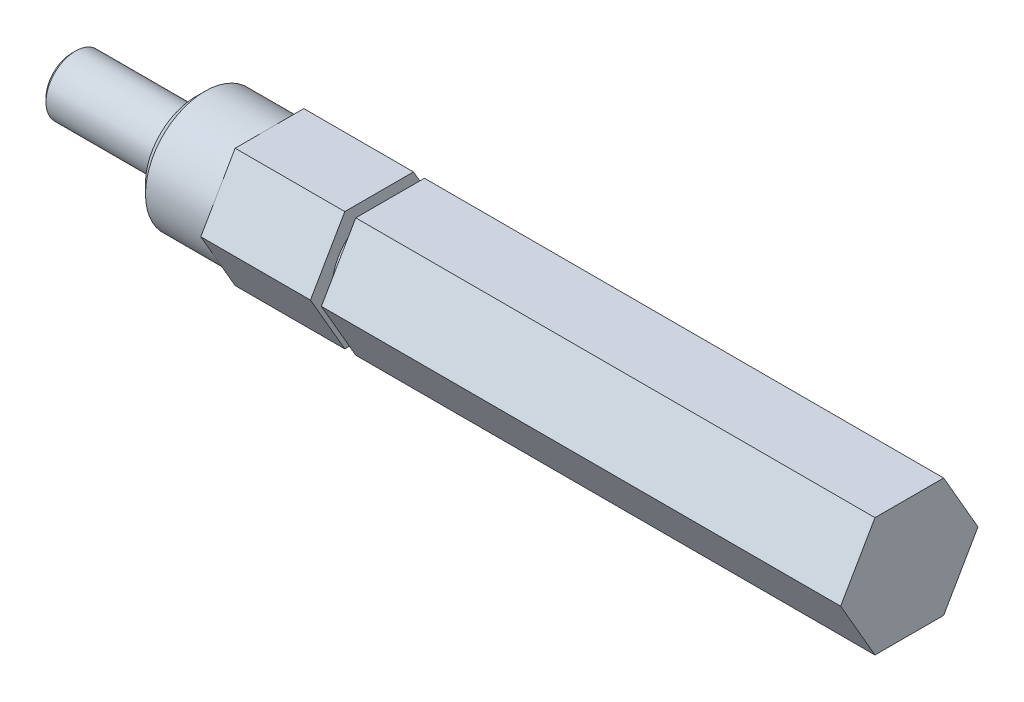
ISO-10303-21;
HEADER;
FILE_DESCRIPTION(('STEP AP214'),'2;1');
FILE_NAME('part.step','',(''),(''),'','','');
FILE_SCHEMA(('AUTOMOTIVE_DESIGN { 1 0 10303 214 1 1 1 1 }'));
ENDSEC;
DATA;
#1=APPLICATION_CONTEXT('core data for automotive mechanical design processes');
#2=APPLICATION_PROTOCOL_DEFINITION('international standard','automotive_design',2000,#1);
#3=PRODUCT_CONTEXT('',#1,'mechanical');
#4=PRODUCT('Part','Part','',(#3));
#5=PRODUCT_RELATED_PRODUCT_CATEGORY('part','',(#4));
#6=PRODUCT_DEFINITION_FORMATION('','',#4);
#7=PRODUCT_DEFINITION_CONTEXT('part definition',#1,'design');
#8=PRODUCT_DEFINITION('design','',#6,#7);
#9=PRODUCT_DEFINITION_SHAPE('','',#8);
#10=(LENGTH_UNIT() NAMED_UNIT(*) SI_UNIT(.MILLI.,.METRE.));
#11=(NAMED_UNIT(*) PLANE_ANGLE_UNIT() SI_UNIT($,.RADIAN.));
#12=(NAMED_UNIT(*) SI_UNIT($,.STERADIAN.) SOLID_ANGLE_UNIT());
#13=UNCERTAINTY_MEASURE_WITH_UNIT(LENGTH_MEASURE(1.E-05),#10,'distance_accuracy_value','');
#14=(GEOMETRIC_REPRESENTATION_CONTEXT(3) GLOBAL_UNCERTAINTY_ASSIGNED_CONTEXT((#13)) GLOBAL_UNIT_ASSIGNED_CONTEXT((#10,
#11,#12)) REPRESENTATION_CONTEXT('',''));
#15=CARTESIAN_POINT('',(0.,0.,0.));
#16=DIRECTION('',(0.,0.,1.));
#17=DIRECTION('',(1.,0.,0.));
#18=AXIS2_PLACEMENT_3D('',#15,#16,#17);
#19=CARTESIAN_POINT('',(63.5,-6.35000000000002,-3.66617420935411));
#20=DIRECTION('',(0.,0.499999999999998,0.86602540378444));
#21=DIRECTION('',(0.,-0.86602540378444,0.499999999999998));
#22=AXIS2_PLACEMENT_3D('',#19,#20,#21);
#23=PLANE('',#22);
#24=DIRECTION('',(0.,0.86602540378444,-0.499999999999998));
#25=VECTOR('',#24,1.);
#26=CARTESIAN_POINT('',(12.7,-6.35000000000002,-3.66617420935411));
#27=LINE('',#26,#25);
#28=CARTESIAN_POINT('',(12.7,-6.35000000000002,-3.66617420935411));
#29=VERTEX_POINT('',#28);
#30=CARTESIAN_POINT('',(12.7,0.,-7.33234841870824));
#31=VERTEX_POINT('',#30);
#32=EDGE_CURVE('E142',#29,#31,#27,.T.);
#33=ORIENTED_EDGE('',*,*,#32,.F.);
#34=DIRECTION('',(1.,0.,0.));
#35=VECTOR('',#34,1.);
#36=CARTESIAN_POINT('',(63.5,-6.35000000000002,-3.66617420935411));
#37=LINE('',#36,#35);
#38=CARTESIAN_POINT('',(-42.7355,-6.35000000000002,-3.66617420935411));
#39=VERTEX_POINT('',#38);
#40=EDGE_CURVE('E40',#29,#39,#37,.F.);
#41=ORIENTED_EDGE('',*,*,#40,.T.);
#42=DIRECTION('',(0.,-0.86602540378444,0.499999999999999));
#43=VECTOR('',#42,1.);
#44=CARTESIAN_POINT('',(-42.7355,0.,-7.33234841870824));
#45=LINE('',#44,#43);
#46=CARTESIAN_POINT('',(-42.7355,0.,-7.33234841870824));
#47=VERTEX_POINT('',#46);
#48=EDGE_CURVE('E207',#47,#39,#45,.T.);
#49=ORIENTED_EDGE('',*,*,#48,.F.);
#50=DIRECTION('',(1.,0.,0.));
#51=VECTOR('',#50,1.);
#52=CARTESIAN_POINT('',(63.5,0.,-7.33234841870824));
#53=LINE('',#52,#51);
#54=EDGE_CURVE('E210',#47,#31,#53,.T.);
#55=ORIENTED_EDGE('',*,*,#54,.T.);
#56=EDGE_LOOP('',(#33,#41,#49,#55));
#57=FACE_BOUND('',#56,.T.);
#58=ADVANCED_FACE('F36',(#57),#23,.F.);
#59=CARTESIAN_POINT('',(63.5,0.,-7.33234841870824));
#60=DIRECTION('',(0.,-0.5,0.866025403784439));
#61=DIRECTION('',(0.,-0.866025403784439,-0.5));
#62=AXIS2_PLACEMENT_3D('',#59,#60,#61);
#63=PLANE('',#62);
#64=DIRECTION('',(0.,0.866025403784439,0.5));
#65=VECTOR('',#64,1.);
#66=CARTESIAN_POINT('',(12.7,0.,-7.33234841870824));
#67=LINE('',#66,#65);
#68=CARTESIAN_POINT('',(12.7,6.35,-3.66617420935412));
#69=VERTEX_POINT('',#68);
#70=EDGE_CURVE('E658',#31,#69,#67,.T.);
#71=ORIENTED_EDGE('',*,*,#70,.F.);
#72=ORIENTED_EDGE('',*,*,#54,.F.);
#73=DIRECTION('',(0.,-0.866025403784439,-0.499999999999999));
#74=VECTOR('',#73,1.);
#75=CARTESIAN_POINT('',(-42.7355,6.35,-3.66617420935412));
#76=LINE('',#75,#74);
#77=CARTESIAN_POINT('',(-42.7355,6.35,-3.66617420935412));
#78=VERTEX_POINT('',#77);
#79=EDGE_CURVE('E195',#78,#47,#76,.T.);
#80=ORIENTED_EDGE('',*,*,#79,.F.);
#81=DIRECTION('',(1.,0.,0.));
#82=VECTOR('',#81,1.);
#83=CARTESIAN_POINT('',(63.5,6.35,-3.66617420935412));
#84=LINE('',#83,#82);
#85=EDGE_CURVE('E190',#78,#69,#84,.T.);
#86=ORIENTED_EDGE('',*,*,#85,.T.);
#87=EDGE_LOOP('',(#71,#72,#80,#86));
#88=FACE_BOUND('',#87,.T.);
#89=ADVANCED_FACE('F384',(#88),#63,.F.);
#90=CARTESIAN_POINT('',(63.5,-6.35000000000002,3.66617420935409));
#91=DIRECTION('',(0.,1.,0.));
#92=DIRECTION('',(0.,0.,1.));
#93=AXIS2_PLACEMENT_3D('',#90,#91,#92);
#94=PLANE('',#93);
#95=DIRECTION('',(0.,0.,-1.));
#96=VECTOR('',#95,1.);
#97=CARTESIAN_POINT('',(12.7,-6.35000000000002,3.66617420935409));
#98=LINE('',#97,#96);
#99=CARTESIAN_POINT('',(12.7,-6.34999999999997,3.66617420935412));
#100=VERTEX_POINT('',#99);
#101=EDGE_CURVE('E659',#100,#29,#98,.T.);
#102=ORIENTED_EDGE('',*,*,#101,.F.);
#103=DIRECTION('',(1.,0.,0.));
#104=VECTOR('',#103,1.);
#105=CARTESIAN_POINT('',(63.5,-6.34999999999997,3.66617420935412));
#106=LINE('',#105,#104);
#107=CARTESIAN_POINT('',(-42.7355000000001,-6.34999999999999,3.66617420935411));
#108=VERTEX_POINT('',#107);
#109=EDGE_CURVE('E163',#100,#108,#106,.F.);
#110=ORIENTED_EDGE('',*,*,#109,.T.);
#111=DIRECTION('',(0.,0.,1.));
#112=VECTOR('',#111,1.);
#113=CARTESIAN_POINT('',(-42.7355,-6.35000000000002,0.));
#114=LINE('',#113,#112);
#115=EDGE_CURVE('E205',#39,#108,#114,.T.);
#116=ORIENTED_EDGE('',*,*,#115,.F.);
#117=ORIENTED_EDGE('',*,*,#40,.F.);
#118=EDGE_LOOP('',(#102,#110,#116,#117));
#119=FACE_BOUND('',#118,.T.);
#120=ADVANCED_FACE('F390',(#119),#94,.F.);
#121=CARTESIAN_POINT('',(63.5,6.35,-3.66617420935412));
#122=DIRECTION('',(0.,-1.,0.));
#123=DIRECTION('',(0.,0.,-1.));
#124=AXIS2_PLACEMENT_3D('',#121,#122,#123);
#125=PLANE('',#124);
#126=DIRECTION('',(0.,0.,1.));
#127=VECTOR('',#126,1.);
#128=CARTESIAN_POINT('',(12.7,6.35,-3.66617420935412));
#129=LINE('',#128,#127);
#130=CARTESIAN_POINT('',(12.7,6.35,3.6661742093541));
#131=VERTEX_POINT('',#130);
#132=EDGE_CURVE('E53',#69,#131,#129,.T.);
#133=ORIENTED_EDGE('',*,*,#132,.F.);
#134=ORIENTED_EDGE('',*,*,#85,.F.);
#135=DIRECTION('',(0.,0.,-1.));
#136=VECTOR('',#135,1.);
#137=CARTESIAN_POINT('',(-42.7355,6.35,-3.66617420935412));
#138=LINE('',#137,#136);
#139=CARTESIAN_POINT('',(-42.7355,6.35,3.6661742093541));
#140=VERTEX_POINT('',#139);
#141=EDGE_CURVE('E62',#140,#78,#138,.T.);
#142=ORIENTED_EDGE('',*,*,#141,.F.);
#143=DIRECTION('',(1.,0.,0.));
#144=VECTOR('',#143,1.);
#145=CARTESIAN_POINT('',(63.5,6.35,3.6661742093541));
#146=LINE('',#145,#144);
#147=EDGE_CURVE('E169',#140,#131,#146,.T.);
#148=ORIENTED_EDGE('',*,*,#147,.T.);
#149=EDGE_LOOP('',(#133,#134,#142,#148));
#150=FACE_BOUND('',#149,.T.);
#151=ADVANCED_FACE('F566',(#150),#125,.F.);
#152=CARTESIAN_POINT('',(63.5,0.,7.33234841870822));
#153=DIRECTION('',(0.,0.5,-0.866025403784439));
#154=DIRECTION('',(0.,0.866025403784439,0.5));
#155=AXIS2_PLACEMENT_3D('',#152,#153,#154);
#156=PLANE('',#155);
#157=DIRECTION('',(0.,-0.866025403784439,-0.5));
#158=VECTOR('',#157,1.);
#159=CARTESIAN_POINT('',(12.7,0.,7.33234841870822));
#160=LINE('',#159,#158);
#161=CARTESIAN_POINT('',(12.7,0.,7.33234841870822));
#162=VERTEX_POINT('',#161);
#163=EDGE_CURVE('E154',#162,#100,#160,.T.);
#164=ORIENTED_EDGE('',*,*,#163,.F.);
#165=DIRECTION('',(1.,0.,0.));
#166=VECTOR('',#165,1.);
#167=CARTESIAN_POINT('',(63.5,0.,7.33234841870822));
#168=LINE('',#167,#166);
#169=CARTESIAN_POINT('',(-42.7355,0.,7.33234841870822));
#170=VERTEX_POINT('',#169);
#171=EDGE_CURVE('E46',#162,#170,#168,.F.);
#172=ORIENTED_EDGE('',*,*,#171,.T.);
#173=DIRECTION('',(0.,0.866025403784439,0.5));
#174=VECTOR('',#173,1.);
#175=CARTESIAN_POINT('',(-42.7355000000001,0.,7.33234841870822));
#176=LINE('',#175,#174);
#177=EDGE_CURVE('E184',#108,#170,#176,.T.);
#178=ORIENTED_EDGE('',*,*,#177,.F.);
#179=ORIENTED_EDGE('',*,*,#109,.F.);
#180=EDGE_LOOP('',(#164,#172,#178,#179));
#181=FACE_BOUND('',#180,.T.);
#182=ADVANCED_FACE('F160',(#181),#156,.F.);
#183=CARTESIAN_POINT('',(63.5,6.35,3.6661742093541));
#184=DIRECTION('',(0.,-0.499999999999999,-0.866025403784439));
#185=DIRECTION('',(0.,0.866025403784439,-0.499999999999999));
#186=AXIS2_PLACEMENT_3D('',#183,#184,#185);
#187=PLANE('',#186);
#188=DIRECTION('',(0.,-0.866025403784439,0.499999999999999));
#189=VECTOR('',#188,1.);
#190=CARTESIAN_POINT('',(12.7,6.35,3.6661742093541));
#191=LINE('',#190,#189);
#192=EDGE_CURVE('E11',#131,#162,#191,.T.);
#193=ORIENTED_EDGE('',*,*,#192,.F.);
#194=ORIENTED_EDGE('',*,*,#147,.F.);
#195=DIRECTION('',(0.,0.866025403784439,-0.499999999999999));
#196=VECTOR('',#195,1.);
#197=CARTESIAN_POINT('',(-42.7355,6.35,3.6661742093541));
#198=LINE('',#197,#196);
#199=EDGE_CURVE('E167',#170,#140,#198,.T.);
#200=ORIENTED_EDGE('',*,*,#199,.F.);
#201=ORIENTED_EDGE('',*,*,#171,.F.);
#202=EDGE_LOOP('',(#193,#194,#200,#201));
#203=FACE_BOUND('',#202,.T.);
#204=ADVANCED_FACE('F165',(#203),#187,.F.);
#205=CARTESIAN_POINT('',(-76.708,0.,0.));
#206=DIRECTION('',(-1.,0.,0.));
#207=DIRECTION('',(0.,0.,1.));
#208=AXIS2_PLACEMENT_3D('',#205,#206,#207);
#209=PLANE('',#208);
#210=CARTESIAN_POINT('',(-76.7079999999964,0.,0.));
#211=DIRECTION('',(1.,0.,0.));
#212=DIRECTION('',(0.,0.,-1.));
#213=AXIS2_PLACEMENT_3D('',#210,#211,#212);
#214=CIRCLE('',#213,2.76860000002443);
#215=CARTESIAN_POINT('',(-76.7079999999964,0.,-2.76860000002443));
#216=VERTEX_POINT('',#215);
#217=EDGE_CURVE('E174',#216,#216,#214,.T.);
#218=ORIENTED_EDGE('',*,*,#217,.F.);
#219=EDGE_LOOP('',(#218));
#220=FACE_BOUND('',#219,.T.);
#221=ADVANCED_FACE('F38',(#220),#209,.T.);
#222=CARTESIAN_POINT('',(-76.326999999992,0.,0.));
#223=DIRECTION('',(1.,0.,0.));
#224=DIRECTION('',(0.,0.,-1.));
#225=AXIS2_PLACEMENT_3D('',#222,#223,#224);
#226=CONICAL_SURFACE('',#225,3.149599999972,0.785398163322851);
#227=ORIENTED_EDGE('',*,*,#217,.T.);
#228=EDGE_LOOP('',(#227));
#229=FACE_BOUND('',#228,.T.);
#230=CARTESIAN_POINT('',(-76.327,0.,0.));
#231=DIRECTION('',(1.,0.,0.));
#232=DIRECTION('',(0.,0.,-1.));
#233=AXIS2_PLACEMENT_3D('',#230,#231,#232);
#234=CIRCLE('',#233,3.1496);
#235=CARTESIAN_POINT('',(-76.327,0.,-3.1496));
#236=VERTEX_POINT('',#235);
#237=EDGE_CURVE('E336',#236,#236,#234,.T.);
#238=ORIENTED_EDGE('',*,*,#237,.F.);
#239=EDGE_LOOP('',(#238));
#240=FACE_BOUND('',#239,.T.);
#241=ADVANCED_FACE('F598',(#229,#240),#226,.T.);
#242=CARTESIAN_POINT('',(-76.708,0.,0.));
#243=DIRECTION('',(1.,0.,0.));
#244=DIRECTION('',(0.,0.,-1.));
#245=AXIS2_PLACEMENT_3D('',#242,#243,#244);
#246=CYLINDRICAL_SURFACE('',#245,3.1496);
#247=ORIENTED_EDGE('',*,*,#237,.T.);
#248=EDGE_LOOP('',(#247));
#249=FACE_BOUND('',#248,.T.);
#250=CARTESIAN_POINT('',(-63.5,0.,0.));
#251=DIRECTION('',(1.,0.,0.));
#252=DIRECTION('',(0.,0.,-1.));
#253=AXIS2_PLACEMENT_3D('',#250,#251,#252);
#254=CIRCLE('',#253,3.1496);
#255=CARTESIAN_POINT('',(-63.5,0.,-3.1496));
#256=VERTEX_POINT('',#255);
#257=EDGE_CURVE('E339',#256,#256,#254,.F.);
#258=ORIENTED_EDGE('',*,*,#257,.T.);
#259=EDGE_LOOP('',(#258));
#260=FACE_BOUND('',#259,.T.);
#261=ADVANCED_FACE('F359',(#249,#260),#246,.T.);
#262=CARTESIAN_POINT('',(-63.5,0.,-7.33234841870824));
#263=DIRECTION('',(1.,0.,0.));
#264=DIRECTION('',(0.,0.,-1.));
#265=AXIS2_PLACEMENT_3D('',#262,#263,#264);
#266=PLANE('',#265);
#267=ORIENTED_EDGE('',*,*,#257,.F.);
#268=EDGE_LOOP('',(#267));
#269=FACE_BOUND('',#268,.T.);
#270=CARTESIAN_POINT('',(-63.4999999999764,0.,0.));
#271=DIRECTION('',(1.,0.,0.));
#272=DIRECTION('',(0.,0.,-1.));
#273=AXIS2_PLACEMENT_3D('',#270,#271,#272);
#274=CIRCLE('',#273,5.35000000002128);
#275=CARTESIAN_POINT('',(-63.4999999999764,0.,-5.35000000002128));
#276=VERTEX_POINT('',#275);
#277=EDGE_CURVE('E335',#276,#276,#274,.T.);
#278=ORIENTED_EDGE('',*,*,#277,.F.);
#279=EDGE_LOOP('',(#278));
#280=FACE_BOUND('',#279,.T.);
#281=ADVANCED_FACE('F361',(#269,#280),#266,.F.);
#282=CARTESIAN_POINT('',(-62.5000000001137,0.,0.));
#283=DIRECTION('',(1.,0.,0.));
#284=DIRECTION('',(0.,0.,-1.));
#285=AXIS2_PLACEMENT_3D('',#282,#283,#284);
#286=CONICAL_SURFACE('',#285,6.34999999988395,0.785398163397448);
#287=ORIENTED_EDGE('',*,*,#277,.T.);
#288=EDGE_LOOP('',(#287));
#289=FACE_BOUND('',#288,.T.);
#290=CARTESIAN_POINT('',(-62.5,0.,0.));
#291=DIRECTION('',(-1.,0.,0.));
#292=DIRECTION('',(0.,0.,1.));
#293=AXIS2_PLACEMENT_3D('',#290,#291,#292);
#294=CIRCLE('',#293,6.35);
#295=CARTESIAN_POINT('',(-62.5,0.,6.35));
#296=VERTEX_POINT('',#295);
#297=EDGE_CURVE('E332',#296,#296,#294,.F.);
#298=ORIENTED_EDGE('',*,*,#297,.F.);
#299=EDGE_LOOP('',(#298));
#300=FACE_BOUND('',#299,.T.);
#301=ADVANCED_FACE('F364',(#289,#300),#286,.T.);
#302=CARTESIAN_POINT('',(-55.6133,0.,0.));
#303=DIRECTION('',(-1.,0.,0.));
#304=DIRECTION('',(0.,0.,1.));
#305=AXIS2_PLACEMENT_3D('',#302,#303,#304);
#306=CYLINDRICAL_SURFACE('',#305,6.35);
#307=CARTESIAN_POINT('',(-55.6133,0.,0.));
#308=DIRECTION('',(-1.,0.,0.));
#309=DIRECTION('',(0.,0.,1.));
#310=AXIS2_PLACEMENT_3D('',#307,#308,#309);
#311=CIRCLE('',#310,6.35);
#312=CARTESIAN_POINT('',(-55.6133,-3.17499999999999,-5.49926131403119));
#313=VERTEX_POINT('',#312);
#314=CARTESIAN_POINT('',(-55.6133,3.175,-5.49926131403119));
#315=VERTEX_POINT('',#314);
#316=EDGE_CURVE('E136',#313,#315,#311,.F.);
#317=ORIENTED_EDGE('',*,*,#316,.F.);
#318=CARTESIAN_POINT('',(-55.6133,0.,0.));
#319=DIRECTION('',(-1.,0.,0.));
#320=DIRECTION('',(0.,0.,1.));
#321=AXIS2_PLACEMENT_3D('',#318,#319,#320);
#322=CIRCLE('',#321,6.35);
#323=CARTESIAN_POINT('',(-55.6133,-6.35000000000001,0.));
#324=VERTEX_POINT('',#323);
#325=EDGE_CURVE('E345',#324,#313,#322,.F.);
#326=ORIENTED_EDGE('',*,*,#325,.F.);
#327=CARTESIAN_POINT('',(-55.6133,0.,0.));
#328=DIRECTION('',(-1.,0.,0.));
#329=DIRECTION('',(0.,0.,1.));
#330=AXIS2_PLACEMENT_3D('',#327,#328,#329);
#331=CIRCLE('',#330,6.35);
#332=CARTESIAN_POINT('',(-55.6133,-3.175,5.49926131403118));
#333=VERTEX_POINT('',#332);
#334=EDGE_CURVE('E329',#333,#324,#331,.F.);
#335=ORIENTED_EDGE('',*,*,#334,.F.);
#336=CARTESIAN_POINT('',(-55.6133,0.,0.));
#337=DIRECTION('',(-1.,0.,0.));
#338=DIRECTION('',(0.,0.,1.));
#339=AXIS2_PLACEMENT_3D('',#336,#337,#338);
#340=CIRCLE('',#339,6.35);
#341=CARTESIAN_POINT('',(-55.6133,3.17499999999999,5.49926131403118));
#342=VERTEX_POINT('',#341);
#343=EDGE_CURVE('E347',#342,#333,#340,.F.);
#344=ORIENTED_EDGE('',*,*,#343,.F.);
#345=CARTESIAN_POINT('',(-55.6133,0.,0.));
#346=DIRECTION('',(-1.,0.,0.));
#347=DIRECTION('',(0.,0.,1.));
#348=AXIS2_PLACEMENT_3D('',#345,#346,#347);
#349=CIRCLE('',#348,6.35);
#350=CARTESIAN_POINT('',(-55.6133,6.35,0.));
#351=VERTEX_POINT('',#350);
#352=EDGE_CURVE('E349',#351,#342,#349,.F.);
#353=ORIENTED_EDGE('',*,*,#352,.F.);
#354=CARTESIAN_POINT('',(-55.6133,0.,0.));
#355=DIRECTION('',(-1.,0.,0.));
#356=DIRECTION('',(0.,0.,1.));
#357=AXIS2_PLACEMENT_3D('',#354,#355,#356);
#358=CIRCLE('',#357,6.35);
#359=EDGE_CURVE('E352',#315,#351,#358,.F.);
#360=ORIENTED_EDGE('',*,*,#359,.F.);
#361=EDGE_LOOP('',(#317,#326,#335,#344,#353,#360));
#362=FACE_BOUND('',#361,.T.);
#363=ORIENTED_EDGE('',*,*,#297,.T.);
#364=EDGE_LOOP('',(#363));
#365=FACE_BOUND('',#364,.T.);
#366=ADVANCED_FACE('F370',(#362,#365),#306,.T.);
#367=CARTESIAN_POINT('',(-55.6133,0.,0.));
#368=DIRECTION('',(-1.,0.,0.));
#369=DIRECTION('',(0.,0.,1.));
#370=AXIS2_PLACEMENT_3D('',#367,#368,#369);
#371=PLANE('',#370);
#372=DIRECTION('',(0.,-0.86602540378444,0.499999999999998));
#373=VECTOR('',#372,1.);
#374=CARTESIAN_POINT('',(-55.6133,-6.35000000000002,-3.66617420935411));
#375=LINE('',#374,#373);
#376=CARTESIAN_POINT('',(-55.6133000000001,0.,-7.33234841870823));
#377=VERTEX_POINT('',#376);
#378=EDGE_CURVE('E266',#377,#313,#375,.T.);
#379=ORIENTED_EDGE('',*,*,#378,.T.);
#380=ORIENTED_EDGE('',*,*,#316,.T.);
#381=DIRECTION('',(0.,-0.866025403784439,-0.5));
#382=VECTOR('',#381,1.);
#383=CARTESIAN_POINT('',(-55.6133000000001,0.,-7.33234841870824));
#384=LINE('',#383,#382);
#385=EDGE_CURVE('E316',#315,#377,#384,.T.);
#386=ORIENTED_EDGE('',*,*,#385,.T.);
#387=EDGE_LOOP('',(#379,#380,#386));
#388=FACE_BOUND('',#387,.T.);
#389=ADVANCED_FACE('F375',(#388),#371,.T.);
#390=CARTESIAN_POINT('',(-55.6133,0.,0.));
#391=DIRECTION('',(-1.,0.,0.));
#392=DIRECTION('',(0.,0.,1.));
#393=AXIS2_PLACEMENT_3D('',#390,#391,#392);
#394=PLANE('',#393);
#395=DIRECTION('',(0.,-0.866025403784439,-0.5));
#396=VECTOR('',#395,1.);
#397=CARTESIAN_POINT('',(-55.6133000000001,0.,-7.33234841870824));
#398=LINE('',#397,#396);
#399=CARTESIAN_POINT('',(-55.6133,6.35000000000001,-3.66617420935409));
#400=VERTEX_POINT('',#399);
#401=EDGE_CURVE('E265',#400,#315,#398,.T.);
#402=ORIENTED_EDGE('',*,*,#401,.T.);
#403=ORIENTED_EDGE('',*,*,#359,.T.);
#404=DIRECTION('',(0.,0.,-1.));
#405=VECTOR('',#404,1.);
#406=CARTESIAN_POINT('',(-55.6133,6.35,-3.66617420935412));
#407=LINE('',#406,#405);
#408=EDGE_CURVE('E302',#351,#400,#407,.T.);
#409=ORIENTED_EDGE('',*,*,#408,.T.);
#410=EDGE_LOOP('',(#402,#403,#409));
#411=FACE_BOUND('',#410,.T.);
#412=ADVANCED_FACE('F380',(#411),#394,.T.);
#413=CARTESIAN_POINT('',(-55.6133,0.,0.));
#414=DIRECTION('',(-1.,0.,0.));
#415=DIRECTION('',(0.,0.,1.));
#416=AXIS2_PLACEMENT_3D('',#413,#414,#415);
#417=PLANE('',#416);
#418=ORIENTED_EDGE('',*,*,#352,.T.);
#419=DIRECTION('',(0.,0.866025403784439,-0.499999999999999));
#420=VECTOR('',#419,1.);
#421=CARTESIAN_POINT('',(-55.6133,6.35,3.6661742093541));
#422=LINE('',#421,#420);
#423=CARTESIAN_POINT('',(-55.6133,6.34999999999999,3.66617420935411));
#424=VERTEX_POINT('',#423);
#425=EDGE_CURVE('E287',#342,#424,#422,.T.);
#426=ORIENTED_EDGE('',*,*,#425,.T.);
#427=DIRECTION('',(0.,0.,-1.));
#428=VECTOR('',#427,1.);
#429=CARTESIAN_POINT('',(-55.6133,6.35,-3.66617420935412));
#430=LINE('',#429,#428);
#431=EDGE_CURVE('E299',#424,#351,#430,.T.);
#432=ORIENTED_EDGE('',*,*,#431,.T.);
#433=EDGE_LOOP('',(#418,#426,#432));
#434=FACE_BOUND('',#433,.T.);
#435=ADVANCED_FACE('F438',(#434),#417,.T.);
#436=CARTESIAN_POINT('',(-55.6133,0.,0.));
#437=DIRECTION('',(-1.,0.,0.));
#438=DIRECTION('',(0.,0.,1.));
#439=AXIS2_PLACEMENT_3D('',#436,#437,#438);
#440=PLANE('',#439);
#441=ORIENTED_EDGE('',*,*,#343,.T.);
#442=DIRECTION('',(0.,0.866025403784439,0.5));
#443=VECTOR('',#442,1.);
#444=CARTESIAN_POINT('',(-55.6133000000001,0.,7.33234841870822));
#445=LINE('',#444,#443);
#446=CARTESIAN_POINT('',(-55.6133000000001,0.,7.33234841870822));
#447=VERTEX_POINT('',#446);
#448=EDGE_CURVE('E254',#333,#447,#445,.T.);
#449=ORIENTED_EDGE('',*,*,#448,.T.);
#450=DIRECTION('',(0.,0.866025403784439,-0.499999999999999));
#451=VECTOR('',#450,1.);
#452=CARTESIAN_POINT('',(-55.6133,6.35,3.6661742093541));
#453=LINE('',#452,#451);
#454=EDGE_CURVE('E284',#447,#342,#453,.T.);
#455=ORIENTED_EDGE('',*,*,#454,.T.);
#456=EDGE_LOOP('',(#441,#449,#455));
#457=FACE_BOUND('',#456,.T.);
#458=ADVANCED_FACE('F434',(#457),#440,.T.);
#459=CARTESIAN_POINT('',(-55.6133,0.,0.));
#460=DIRECTION('',(-1.,0.,0.));
#461=DIRECTION('',(0.,0.,1.));
#462=AXIS2_PLACEMENT_3D('',#459,#460,#461);
#463=PLANE('',#462);
#464=DIRECTION('',(0.,0.,1.));
#465=VECTOR('',#464,1.);
#466=CARTESIAN_POINT('',(-55.6133,-6.35000000000002,3.66617420935409));
#467=LINE('',#466,#465);
#468=CARTESIAN_POINT('',(-55.6133,-6.35000000000003,-3.6661742093541));
#469=VERTEX_POINT('',#468);
#470=EDGE_CURVE('E235',#469,#324,#467,.T.);
#471=ORIENTED_EDGE('',*,*,#470,.T.);
#472=ORIENTED_EDGE('',*,*,#325,.T.);
#473=DIRECTION('',(0.,-0.86602540378444,0.499999999999998));
#474=VECTOR('',#473,1.);
#475=CARTESIAN_POINT('',(-55.6133,-6.35000000000002,-3.66617420935411));
#476=LINE('',#475,#474);
#477=EDGE_CURVE('E263',#313,#469,#476,.T.);
#478=ORIENTED_EDGE('',*,*,#477,.T.);
#479=EDGE_LOOP('',(#471,#472,#478));
#480=FACE_BOUND('',#479,.T.);
#481=ADVANCED_FACE('F430',(#480),#463,.T.);
#482=CARTESIAN_POINT('',(-55.6133,0.,0.));
#483=DIRECTION('',(-1.,0.,0.));
#484=DIRECTION('',(0.,0.,1.));
#485=AXIS2_PLACEMENT_3D('',#482,#483,#484);
#486=PLANE('',#485);
#487=ORIENTED_EDGE('',*,*,#334,.T.);
#488=DIRECTION('',(0.,0.,1.));
#489=VECTOR('',#488,1.);
#490=CARTESIAN_POINT('',(-55.6133,-6.35000000000002,3.66617420935409));
#491=LINE('',#490,#489);
#492=CARTESIAN_POINT('',(-55.6133,-6.35000000000002,3.66617420935407));
#493=VERTEX_POINT('',#492);
#494=EDGE_CURVE('E238',#324,#493,#491,.T.);
#495=ORIENTED_EDGE('',*,*,#494,.T.);
#496=DIRECTION('',(0.,0.866025403784439,0.5));
#497=VECTOR('',#496,1.);
#498=CARTESIAN_POINT('',(-55.6133000000001,0.,7.33234841870822));
#499=LINE('',#498,#497);
#500=EDGE_CURVE('E251',#493,#333,#499,.T.);
#501=ORIENTED_EDGE('',*,*,#500,.T.);
#502=EDGE_LOOP('',(#487,#495,#501));
#503=FACE_BOUND('',#502,.T.);
#504=ADVANCED_FACE('F426',(#503),#486,.T.);
#505=CARTESIAN_POINT('',(63.5,-6.35000000000002,-3.66617420935411));
#506=DIRECTION('',(0.,0.499999999999998,0.86602540378444));
#507=DIRECTION('',(0.,-0.86602540378444,0.499999999999998));
#508=AXIS2_PLACEMENT_3D('',#505,#506,#507);
#509=PLANE('',#508);
#510=DIRECTION('',(1.,0.,0.));
#511=VECTOR('',#510,1.);
#512=CARTESIAN_POINT('',(63.5,-6.35000000000002,-3.66617420935411));
#513=LINE('',#512,#511);
#514=CARTESIAN_POINT('',(-43.9039,-6.35000000000002,-3.66617420935411));
#515=VERTEX_POINT('',#514);
#516=EDGE_CURVE('E239',#515,#469,#513,.F.);
#517=ORIENTED_EDGE('',*,*,#516,.T.);
#518=ORIENTED_EDGE('',*,*,#477,.F.);
#519=ORIENTED_EDGE('',*,*,#378,.F.);
#520=DIRECTION('',(1.,0.,0.));
#521=VECTOR('',#520,1.);
#522=CARTESIAN_POINT('',(63.5,0.,-7.33234841870822));
#523=LINE('',#522,#521);
#524=CARTESIAN_POINT('',(-43.9039,0.,-7.33234841870823));
#525=VERTEX_POINT('',#524);
#526=EDGE_CURVE('E303',#377,#525,#523,.T.);
#527=ORIENTED_EDGE('',*,*,#526,.T.);
#528=DIRECTION('',(0.,0.86602540378444,-0.499999999999999));
#529=VECTOR('',#528,1.);
#530=CARTESIAN_POINT('',(-43.9039,-6.35000000000002,-3.66617420935411));
#531=LINE('',#530,#529);
#532=EDGE_CURVE('E234',#515,#525,#531,.T.);
#533=ORIENTED_EDGE('',*,*,#532,.F.);
#534=EDGE_LOOP('',(#517,#518,#519,#527,#533));
#535=FACE_BOUND('',#534,.T.);
#536=ADVANCED_FACE('F422',(#535),#509,.F.);
#537=CARTESIAN_POINT('',(63.5,0.,-7.33234841870824));
#538=DIRECTION('',(0.,-0.5,0.866025403784439));
#539=DIRECTION('',(0.,-0.866025403784439,-0.5));
#540=AXIS2_PLACEMENT_3D('',#537,#538,#539);
#541=PLANE('',#540);
#542=ORIENTED_EDGE('',*,*,#526,.F.);
#543=ORIENTED_EDGE('',*,*,#385,.F.);
#544=ORIENTED_EDGE('',*,*,#401,.F.);
#545=DIRECTION('',(1.,0.,0.));
#546=VECTOR('',#545,1.);
#547=CARTESIAN_POINT('',(63.5,6.35,-3.66617420935407));
#548=LINE('',#547,#546);
#549=CARTESIAN_POINT('',(-43.9039,6.35,-3.66617420935411));
#550=VERTEX_POINT('',#549);
#551=EDGE_CURVE('E288',#400,#550,#548,.T.);
#552=ORIENTED_EDGE('',*,*,#551,.T.);
#553=DIRECTION('',(0.,0.866025403784439,0.499999999999999));
#554=VECTOR('',#553,1.);
#555=CARTESIAN_POINT('',(-43.9039,0.,-7.33234841870824));
#556=LINE('',#555,#554);
#557=EDGE_CURVE('E232',#525,#550,#556,.T.);
#558=ORIENTED_EDGE('',*,*,#557,.F.);
#559=EDGE_LOOP('',(#542,#543,#544,#552,#558));
#560=FACE_BOUND('',#559,.T.);
#561=ADVANCED_FACE('F418',(#560),#541,.F.);
#562=CARTESIAN_POINT('',(63.5,6.35,-3.66617420935412));
#563=DIRECTION('',(0.,-1.,0.));
#564=DIRECTION('',(0.,0.,-1.));
#565=AXIS2_PLACEMENT_3D('',#562,#563,#564);
#566=PLANE('',#565);
#567=ORIENTED_EDGE('',*,*,#551,.F.);
#568=ORIENTED_EDGE('',*,*,#408,.F.);
#569=ORIENTED_EDGE('',*,*,#431,.F.);
#570=DIRECTION('',(1.,0.,0.));
#571=VECTOR('',#570,1.);
#572=CARTESIAN_POINT('',(63.5,6.34999999999997,3.66617420935412));
#573=LINE('',#572,#571);
#574=CARTESIAN_POINT('',(-43.9039,6.34999999999999,3.6661742093541));
#575=VERTEX_POINT('',#574);
#576=EDGE_CURVE('E255',#424,#575,#573,.T.);
#577=ORIENTED_EDGE('',*,*,#576,.T.);
#578=DIRECTION('',(0.,0.,-1.));
#579=VECTOR('',#578,1.);
#580=CARTESIAN_POINT('',(-43.9039,6.35,0.));
#581=LINE('',#580,#579);
#582=EDGE_CURVE('E230',#550,#575,#581,.F.);
#583=ORIENTED_EDGE('',*,*,#582,.F.);
#584=EDGE_LOOP('',(#567,#568,#569,#577,#583));
#585=FACE_BOUND('',#584,.T.);
#586=ADVANCED_FACE('F414',(#585),#566,.F.);
#587=CARTESIAN_POINT('',(63.5,6.35,3.6661742093541));
#588=DIRECTION('',(0.,-0.499999999999999,-0.866025403784439));
#589=DIRECTION('',(0.,0.866025403784439,-0.499999999999999));
#590=AXIS2_PLACEMENT_3D('',#587,#588,#589);
#591=PLANE('',#590);
#592=ORIENTED_EDGE('',*,*,#576,.F.);
#593=ORIENTED_EDGE('',*,*,#425,.F.);
#594=ORIENTED_EDGE('',*,*,#454,.F.);
#595=DIRECTION('',(1.,0.,0.));
#596=VECTOR('',#595,1.);
#597=CARTESIAN_POINT('',(63.5,0.,7.33234841870822));
#598=LINE('',#597,#596);
#599=CARTESIAN_POINT('',(-43.9039,0.,7.33234841870822));
#600=VERTEX_POINT('',#599);
#601=EDGE_CURVE('E260',#447,#600,#598,.T.);
#602=ORIENTED_EDGE('',*,*,#601,.T.);
#603=DIRECTION('',(0.,-0.866025403784439,0.499999999999999));
#604=VECTOR('',#603,1.);
#605=CARTESIAN_POINT('',(-43.9039,6.35,3.6661742093541));
#606=LINE('',#605,#604);
#607=EDGE_CURVE('E228',#575,#600,#606,.T.);
#608=ORIENTED_EDGE('',*,*,#607,.F.);
#609=EDGE_LOOP('',(#592,#593,#594,#602,#608));
#610=FACE_BOUND('',#609,.T.);
#611=ADVANCED_FACE('F410',(#610),#591,.F.);
#612=CARTESIAN_POINT('',(63.5,0.,7.33234841870822));
#613=DIRECTION('',(0.,0.5,-0.866025403784439));
#614=DIRECTION('',(0.,0.866025403784439,0.5));
#615=AXIS2_PLACEMENT_3D('',#612,#613,#614);
#616=PLANE('',#615);
#617=ORIENTED_EDGE('',*,*,#601,.F.);
#618=ORIENTED_EDGE('',*,*,#448,.F.);
#619=ORIENTED_EDGE('',*,*,#500,.F.);
#620=DIRECTION('',(1.,0.,0.));
#621=VECTOR('',#620,1.);
#622=CARTESIAN_POINT('',(63.5,-6.35000000000002,3.66617420935404));
#623=LINE('',#622,#621);
#624=CARTESIAN_POINT('',(-43.9039,-6.35000000000002,3.66617420935408));
#625=VERTEX_POINT('',#624);
#626=EDGE_CURVE('E244',#493,#625,#623,.T.);
#627=ORIENTED_EDGE('',*,*,#626,.T.);
#628=DIRECTION('',(0.,-0.866025403784439,-0.5));
#629=VECTOR('',#628,1.);
#630=CARTESIAN_POINT('',(-43.9039,0.,7.33234841870822));
#631=LINE('',#630,#629);
#632=EDGE_CURVE('E225',#600,#625,#631,.T.);
#633=ORIENTED_EDGE('',*,*,#632,.F.);
#634=EDGE_LOOP('',(#617,#618,#619,#627,#633));
#635=FACE_BOUND('',#634,.T.);
#636=ADVANCED_FACE('F406',(#635),#616,.F.);
#637=CARTESIAN_POINT('',(63.5,-6.35000000000002,3.66617420935409));
#638=DIRECTION('',(0.,1.,0.));
#639=DIRECTION('',(0.,0.,1.));
#640=AXIS2_PLACEMENT_3D('',#637,#638,#639);
#641=PLANE('',#640);
#642=ORIENTED_EDGE('',*,*,#626,.F.);
#643=ORIENTED_EDGE('',*,*,#494,.F.);
#644=ORIENTED_EDGE('',*,*,#470,.F.);
#645=ORIENTED_EDGE('',*,*,#516,.F.);
#646=DIRECTION('',(0.,0.,-1.));
#647=VECTOR('',#646,1.);
#648=CARTESIAN_POINT('',(-43.9039,-6.35000000000001,0.));
#649=LINE('',#648,#647);
#650=EDGE_CURVE('E227',#625,#515,#649,.T.);
#651=ORIENTED_EDGE('',*,*,#650,.F.);
#652=EDGE_LOOP('',(#642,#643,#644,#645,#651));
#653=FACE_BOUND('',#652,.T.);
#654=ADVANCED_FACE('F402',(#653),#641,.F.);
#655=CARTESIAN_POINT('',(-43.9039,7.5692,0.));
#656=DIRECTION('',(1.,0.,0.));
#657=DIRECTION('',(0.,0.,-1.));
#658=AXIS2_PLACEMENT_3D('',#655,#656,#657);
#659=PLANE('',#658);
#660=ORIENTED_EDGE('',*,*,#632,.T.);
#661=ORIENTED_EDGE('',*,*,#650,.T.);
#662=ORIENTED_EDGE('',*,*,#532,.T.);
#663=ORIENTED_EDGE('',*,*,#557,.T.);
#664=ORIENTED_EDGE('',*,*,#582,.T.);
#665=ORIENTED_EDGE('',*,*,#607,.T.);
#666=EDGE_LOOP('',(#660,#661,#662,#663,#664,#665));
#667=FACE_BOUND('',#666,.T.);
#668=CARTESIAN_POINT('',(-43.9039,0.,0.));
#669=DIRECTION('',(-1.,0.,0.));
#670=DIRECTION('',(0.,0.,1.));
#671=AXIS2_PLACEMENT_3D('',#668,#669,#670);
#672=CIRCLE('',#671,5.0292);
#673=CARTESIAN_POINT('',(-43.9039,0.,5.0292));
#674=VERTEX_POINT('',#673);
#675=EDGE_CURVE('E213',#674,#674,#672,.F.);
#676=ORIENTED_EDGE('',*,*,#675,.F.);
#677=EDGE_LOOP('',(#676));
#678=FACE_BOUND('',#677,.T.);
#679=ADVANCED_FACE('F398',(#667,#678),#659,.T.);
#680=CARTESIAN_POINT('',(-78.984221990192,0.,0.));
#681=DIRECTION('',(-1.,0.,0.));
#682=DIRECTION('',(0.,0.,1.));
#683=AXIS2_PLACEMENT_3D('',#680,#681,#682);
#684=CYLINDRICAL_SURFACE('',#683,5.0292);
#685=CARTESIAN_POINT('',(-42.7355,0.,0.));
#686=DIRECTION('',(-1.,0.,0.));
#687=DIRECTION('',(0.,0.,1.));
#688=AXIS2_PLACEMENT_3D('',#685,#686,#687);
#689=CIRCLE('',#688,5.0292);
#690=CARTESIAN_POINT('',(-42.7355,0.,5.0292));
#691=VERTEX_POINT('',#690);
#692=EDGE_CURVE('E222',#691,#691,#689,.F.);
#693=ORIENTED_EDGE('',*,*,#692,.F.);
#694=EDGE_LOOP('',(#693));
#695=FACE_BOUND('',#694,.T.);
#696=ORIENTED_EDGE('',*,*,#675,.T.);
#697=EDGE_LOOP('',(#696));
#698=FACE_BOUND('',#697,.T.);
#699=ADVANCED_FACE('F394',(#695,#698),#684,.T.);
#700=CARTESIAN_POINT('',(-42.7355,7.5692,0.));
#701=DIRECTION('',(-1.,0.,0.));
#702=DIRECTION('',(0.,0.,1.));
#703=AXIS2_PLACEMENT_3D('',#700,#701,#702);
#704=PLANE('',#703);
#705=ORIENTED_EDGE('',*,*,#141,.T.);
#706=ORIENTED_EDGE('',*,*,#79,.T.);
#707=ORIENTED_EDGE('',*,*,#48,.T.);
#708=ORIENTED_EDGE('',*,*,#115,.T.);
#709=ORIENTED_EDGE('',*,*,#177,.T.);
#710=ORIENTED_EDGE('',*,*,#199,.T.);
#711=EDGE_LOOP('',(#705,#706,#707,#708,#709,#710));
#712=FACE_BOUND('',#711,.T.);
#713=ORIENTED_EDGE('',*,*,#692,.T.);
#714=EDGE_LOOP('',(#713));
#715=FACE_BOUND('',#714,.T.);
#716=ADVANCED_FACE('F397',(#712,#715),#704,.T.);
#717=CARTESIAN_POINT('',(12.7,-10.33782363669,70.4867241141081));
#718=DIRECTION('',(1.,0.,0.));
#719=DIRECTION('',(0.,0.,-1.));
#720=AXIS2_PLACEMENT_3D('',#717,#718,#719);
#721=PLANE('',#720);
#722=ORIENTED_EDGE('',*,*,#32,.T.);
#723=ORIENTED_EDGE('',*,*,#70,.T.);
#724=ORIENTED_EDGE('',*,*,#132,.T.);
#725=ORIENTED_EDGE('',*,*,#192,.T.);
#726=ORIENTED_EDGE('',*,*,#163,.T.);
#727=ORIENTED_EDGE('',*,*,#101,.T.);
#728=EDGE_LOOP('',(#722,#723,#724,#725,#726,#727));
#729=FACE_BOUND('',#728,.T.);
#730=ADVANCED_FACE('F153',(#729),#721,.T.);
#731=CLOSED_SHELL('',(#58,#89,#120,#151,#182,#204,#221,#241,#261,#281,#301,#366,#389,#412,#435,
#458,#481,#504,#536,#561,#586,#611,#636,#654,#679,#699,#716,#730));
#732=MANIFOLD_SOLID_BREP('B2',#731);
#733=ADVANCED_BREP_SHAPE_REPRESENTATION('',(#18,#732),#14);
#734=SHAPE_DEFINITION_REPRESENTATION(#9,#733);
ENDSEC;
END-ISO-10303-21;
